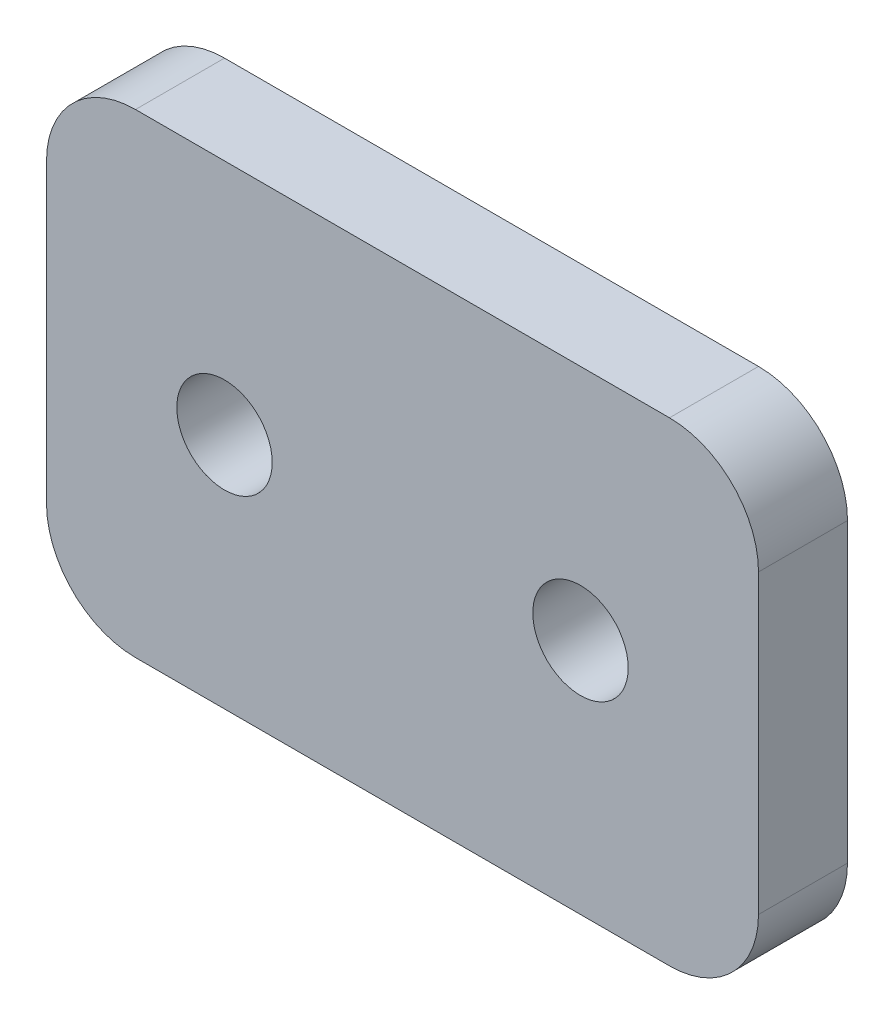
ISO-10303-21;
HEADER;
FILE_DESCRIPTION(('STEP AP214'),'2;1');
FILE_NAME('part.step','',(''),(''),'','','');
FILE_SCHEMA(('AUTOMOTIVE_DESIGN { 1 0 10303 214 1 1 1 1 }'));
ENDSEC;
DATA;
#1=APPLICATION_CONTEXT('core data for automotive mechanical design processes');
#2=APPLICATION_PROTOCOL_DEFINITION('international standard','automotive_design',2000,#1);
#3=PRODUCT_CONTEXT('',#1,'mechanical');
#4=PRODUCT('Part','Part','',(#3));
#5=PRODUCT_RELATED_PRODUCT_CATEGORY('part','',(#4));
#6=PRODUCT_DEFINITION_FORMATION('','',#4);
#7=PRODUCT_DEFINITION_CONTEXT('part definition',#1,'design');
#8=PRODUCT_DEFINITION('design','',#6,#7);
#9=PRODUCT_DEFINITION_SHAPE('','',#8);
#10=(LENGTH_UNIT() NAMED_UNIT(*) SI_UNIT(.MILLI.,.METRE.));
#11=(NAMED_UNIT(*) PLANE_ANGLE_UNIT() SI_UNIT($,.RADIAN.));
#12=(NAMED_UNIT(*) SI_UNIT($,.STERADIAN.) SOLID_ANGLE_UNIT());
#13=UNCERTAINTY_MEASURE_WITH_UNIT(LENGTH_MEASURE(1.E-05),#10,'distance_accuracy_value','');
#14=(GEOMETRIC_REPRESENTATION_CONTEXT(3) GLOBAL_UNCERTAINTY_ASSIGNED_CONTEXT((#13)) GLOBAL_UNIT_ASSIGNED_CONTEXT((#10,
#11,#12)) REPRESENTATION_CONTEXT('',''));
#15=CARTESIAN_POINT('',(0.,0.,0.));
#16=DIRECTION('',(0.,0.,1.));
#17=DIRECTION('',(1.,0.,0.));
#18=AXIS2_PLACEMENT_3D('',#15,#16,#17);
#19=CARTESIAN_POINT('',(0.,0.,4.7625));
#20=DIRECTION('',(0.,0.,-1.));
#21=DIRECTION('',(-1.,0.,0.));
#22=AXIS2_PLACEMENT_3D('',#19,#20,#21);
#23=PLANE('',#22);
#24=DIRECTION('',(-1.,0.,0.));
#25=VECTOR('',#24,1.);
#26=CARTESIAN_POINT('',(0.,25.4,4.7625));
#27=LINE('',#26,#25);
#28=CARTESIAN_POINT('',(33.3375,25.4,4.7625));
#29=VERTEX_POINT('',#28);
#30=CARTESIAN_POINT('',(4.7625,25.4,4.7625));
#31=VERTEX_POINT('',#30);
#32=EDGE_CURVE('E138',#29,#31,#27,.T.);
#33=ORIENTED_EDGE('',*,*,#32,.T.);
#34=CARTESIAN_POINT('',(4.7625,20.6375,4.7625));
#35=DIRECTION('',(0.,0.,-1.));
#36=DIRECTION('',(-1.,0.,0.));
#37=AXIS2_PLACEMENT_3D('',#34,#35,#36);
#38=CIRCLE('',#37,4.7625);
#39=CARTESIAN_POINT('',(0.,20.6375,4.7625));
#40=VERTEX_POINT('',#39);
#41=EDGE_CURVE('E157',#31,#40,#38,.F.);
#42=ORIENTED_EDGE('',*,*,#41,.T.);
#43=DIRECTION('',(0.,-1.,0.));
#44=VECTOR('',#43,1.);
#45=CARTESIAN_POINT('',(0.,0.,4.7625));
#46=LINE('',#45,#44);
#47=CARTESIAN_POINT('',(0.,4.7625,4.7625));
#48=VERTEX_POINT('',#47);
#49=EDGE_CURVE('E121',#40,#48,#46,.T.);
#50=ORIENTED_EDGE('',*,*,#49,.T.);
#51=CARTESIAN_POINT('',(4.7625,4.7625,4.7625));
#52=DIRECTION('',(0.,0.,-1.));
#53=DIRECTION('',(-1.,0.,0.));
#54=AXIS2_PLACEMENT_3D('',#51,#52,#53);
#55=CIRCLE('',#54,4.7625);
#56=CARTESIAN_POINT('',(4.7625,0.,4.7625));
#57=VERTEX_POINT('',#56);
#58=EDGE_CURVE('E155',#48,#57,#55,.F.);
#59=ORIENTED_EDGE('',*,*,#58,.T.);
#60=DIRECTION('',(1.,0.,0.));
#61=VECTOR('',#60,1.);
#62=CARTESIAN_POINT('',(0.,0.,4.7625));
#63=LINE('',#62,#61);
#64=CARTESIAN_POINT('',(33.3375,0.,4.7625));
#65=VERTEX_POINT('',#64);
#66=EDGE_CURVE('E168',#57,#65,#63,.T.);
#67=ORIENTED_EDGE('',*,*,#66,.T.);
#68=CARTESIAN_POINT('',(33.3375,4.7625,4.7625));
#69=DIRECTION('',(0.,0.,-1.));
#70=DIRECTION('',(-1.,0.,0.));
#71=AXIS2_PLACEMENT_3D('',#68,#69,#70);
#72=CIRCLE('',#71,4.7625);
#73=CARTESIAN_POINT('',(38.1,4.7625,4.7625));
#74=VERTEX_POINT('',#73);
#75=EDGE_CURVE('E56',#65,#74,#72,.F.);
#76=ORIENTED_EDGE('',*,*,#75,.T.);
#77=DIRECTION('',(0.,1.,0.));
#78=VECTOR('',#77,1.);
#79=CARTESIAN_POINT('',(38.1,0.,4.7625));
#80=LINE('',#79,#78);
#81=CARTESIAN_POINT('',(38.1,20.6375,4.7625));
#82=VERTEX_POINT('',#81);
#83=EDGE_CURVE('E176',#74,#82,#80,.T.);
#84=ORIENTED_EDGE('',*,*,#83,.T.);
#85=CARTESIAN_POINT('',(33.3375,20.6375,4.7625));
#86=DIRECTION('',(0.,0.,-1.));
#87=DIRECTION('',(-1.,0.,0.));
#88=AXIS2_PLACEMENT_3D('',#85,#86,#87);
#89=CIRCLE('',#88,4.7625);
#90=EDGE_CURVE('E152',#82,#29,#89,.F.);
#91=ORIENTED_EDGE('',*,*,#90,.T.);
#92=EDGE_LOOP('',(#33,#42,#50,#59,#67,#76,#84,#91));
#93=FACE_BOUND('',#92,.T.);
#94=CARTESIAN_POINT('',(9.525,12.7,4.7625));
#95=DIRECTION('',(0.,0.,1.));
#96=DIRECTION('',(1.,0.,0.));
#97=AXIS2_PLACEMENT_3D('',#94,#95,#96);
#98=CIRCLE('',#97,2.5527);
#99=CARTESIAN_POINT('',(12.0777,12.7,4.7625));
#100=VERTEX_POINT('',#99);
#101=EDGE_CURVE('E129',#100,#100,#98,.T.);
#102=ORIENTED_EDGE('',*,*,#101,.F.);
#103=EDGE_LOOP('',(#102));
#104=FACE_BOUND('',#103,.T.);
#105=CARTESIAN_POINT('',(28.575,12.7,4.7625));
#106=DIRECTION('',(0.,0.,1.));
#107=DIRECTION('',(1.,0.,0.));
#108=AXIS2_PLACEMENT_3D('',#105,#106,#107);
#109=CIRCLE('',#108,2.5527);
#110=CARTESIAN_POINT('',(31.1277,12.7,4.7625));
#111=VERTEX_POINT('',#110);
#112=EDGE_CURVE('E183',#111,#111,#109,.T.);
#113=ORIENTED_EDGE('',*,*,#112,.F.);
#114=EDGE_LOOP('',(#113));
#115=FACE_BOUND('',#114,.T.);
#116=ADVANCED_FACE('F35',(#93,#104,#115),#23,.F.);
#117=CARTESIAN_POINT('',(0.,0.,0.));
#118=DIRECTION('',(0.,0.,-1.));
#119=DIRECTION('',(-1.,0.,0.));
#120=AXIS2_PLACEMENT_3D('',#117,#118,#119);
#121=PLANE('',#120);
#122=CARTESIAN_POINT('',(9.525,12.7,0.));
#123=DIRECTION('',(0.,0.,1.));
#124=DIRECTION('',(1.,0.,0.));
#125=AXIS2_PLACEMENT_3D('',#122,#123,#124);
#126=CIRCLE('',#125,2.5527);
#127=CARTESIAN_POINT('',(12.0777,12.7,0.));
#128=VERTEX_POINT('',#127);
#129=EDGE_CURVE('E135',#128,#128,#126,.T.);
#130=ORIENTED_EDGE('',*,*,#129,.T.);
#131=EDGE_LOOP('',(#130));
#132=FACE_BOUND('',#131,.T.);
#133=DIRECTION('',(0.,-1.,0.));
#134=VECTOR('',#133,1.);
#135=CARTESIAN_POINT('',(0.,0.,0.));
#136=LINE('',#135,#134);
#137=CARTESIAN_POINT('',(0.,20.6375,0.));
#138=VERTEX_POINT('',#137);
#139=CARTESIAN_POINT('',(0.,4.7625,0.));
#140=VERTEX_POINT('',#139);
#141=EDGE_CURVE('E118',#138,#140,#136,.T.);
#142=ORIENTED_EDGE('',*,*,#141,.F.);
#143=CARTESIAN_POINT('',(4.7625,20.6375,0.));
#144=DIRECTION('',(0.,0.,-1.));
#145=DIRECTION('',(-1.,0.,0.));
#146=AXIS2_PLACEMENT_3D('',#143,#144,#145);
#147=CIRCLE('',#146,4.7625);
#148=CARTESIAN_POINT('',(4.7625,25.4,0.));
#149=VERTEX_POINT('',#148);
#150=EDGE_CURVE('E101',#138,#149,#147,.T.);
#151=ORIENTED_EDGE('',*,*,#150,.T.);
#152=DIRECTION('',(-1.,0.,0.));
#153=VECTOR('',#152,1.);
#154=CARTESIAN_POINT('',(0.,25.4,0.));
#155=LINE('',#154,#153);
#156=CARTESIAN_POINT('',(33.3375,25.4,0.));
#157=VERTEX_POINT('',#156);
#158=EDGE_CURVE('E142',#157,#149,#155,.T.);
#159=ORIENTED_EDGE('',*,*,#158,.F.);
#160=CARTESIAN_POINT('',(33.3375,20.6375,0.));
#161=DIRECTION('',(0.,0.,-1.));
#162=DIRECTION('',(-1.,0.,0.));
#163=AXIS2_PLACEMENT_3D('',#160,#161,#162);
#164=CIRCLE('',#163,4.7625);
#165=CARTESIAN_POINT('',(38.1,20.6375,0.));
#166=VERTEX_POINT('',#165);
#167=EDGE_CURVE('E122',#157,#166,#164,.T.);
#168=ORIENTED_EDGE('',*,*,#167,.T.);
#169=DIRECTION('',(0.,1.,0.));
#170=VECTOR('',#169,1.);
#171=CARTESIAN_POINT('',(38.1,0.,0.));
#172=LINE('',#171,#170);
#173=CARTESIAN_POINT('',(38.1,4.7625,0.));
#174=VERTEX_POINT('',#173);
#175=EDGE_CURVE('E132',#174,#166,#172,.T.);
#176=ORIENTED_EDGE('',*,*,#175,.F.);
#177=CARTESIAN_POINT('',(33.3375,4.7625,0.));
#178=DIRECTION('',(0.,0.,-1.));
#179=DIRECTION('',(-1.,0.,0.));
#180=AXIS2_PLACEMENT_3D('',#177,#178,#179);
#181=CIRCLE('',#180,4.7625);
#182=CARTESIAN_POINT('',(33.3375,0.,0.));
#183=VERTEX_POINT('',#182);
#184=EDGE_CURVE('E146',#174,#183,#181,.T.);
#185=ORIENTED_EDGE('',*,*,#184,.T.);
#186=DIRECTION('',(1.,0.,0.));
#187=VECTOR('',#186,1.);
#188=CARTESIAN_POINT('',(0.,0.,0.));
#189=LINE('',#188,#187);
#190=CARTESIAN_POINT('',(4.7625,0.,0.));
#191=VERTEX_POINT('',#190);
#192=EDGE_CURVE('E128',#191,#183,#189,.T.);
#193=ORIENTED_EDGE('',*,*,#192,.F.);
#194=CARTESIAN_POINT('',(4.7625,4.7625,0.));
#195=DIRECTION('',(0.,0.,-1.));
#196=DIRECTION('',(-1.,0.,0.));
#197=AXIS2_PLACEMENT_3D('',#194,#195,#196);
#198=CIRCLE('',#197,4.7625);
#199=EDGE_CURVE('E112',#191,#140,#198,.T.);
#200=ORIENTED_EDGE('',*,*,#199,.T.);
#201=EDGE_LOOP('',(#142,#151,#159,#168,#176,#185,#193,#200));
#202=FACE_BOUND('',#201,.T.);
#203=CARTESIAN_POINT('',(28.575,12.7,0.));
#204=DIRECTION('',(0.,0.,1.));
#205=DIRECTION('',(1.,0.,0.));
#206=AXIS2_PLACEMENT_3D('',#203,#204,#205);
#207=CIRCLE('',#206,2.5527);
#208=CARTESIAN_POINT('',(31.1277,12.7,0.));
#209=VERTEX_POINT('',#208);
#210=EDGE_CURVE('E185',#209,#209,#207,.T.);
#211=ORIENTED_EDGE('',*,*,#210,.T.);
#212=EDGE_LOOP('',(#211));
#213=FACE_BOUND('',#212,.T.);
#214=ADVANCED_FACE('F125',(#132,#202,#213),#121,.T.);
#215=CARTESIAN_POINT('',(0.,0.,4.7625));
#216=DIRECTION('',(1.,0.,0.));
#217=DIRECTION('',(0.,0.,-1.));
#218=AXIS2_PLACEMENT_3D('',#215,#216,#217);
#219=PLANE('',#218);
#220=ORIENTED_EDGE('',*,*,#49,.F.);
#221=DIRECTION('',(0.,0.,-1.));
#222=VECTOR('',#221,1.);
#223=CARTESIAN_POINT('',(0.,20.6375,4.7625));
#224=LINE('',#223,#222);
#225=EDGE_CURVE('E105',#40,#138,#224,.T.);
#226=ORIENTED_EDGE('',*,*,#225,.T.);
#227=ORIENTED_EDGE('',*,*,#141,.T.);
#228=DIRECTION('',(0.,0.,-1.));
#229=VECTOR('',#228,1.);
#230=CARTESIAN_POINT('',(0.,4.7625,4.7625));
#231=LINE('',#230,#229);
#232=EDGE_CURVE('E123',#140,#48,#231,.F.);
#233=ORIENTED_EDGE('',*,*,#232,.T.);
#234=EDGE_LOOP('',(#220,#226,#227,#233));
#235=FACE_BOUND('',#234,.T.);
#236=ADVANCED_FACE('F117',(#235),#219,.F.);
#237=CARTESIAN_POINT('',(0.,0.,4.7625));
#238=DIRECTION('',(0.,1.,0.));
#239=DIRECTION('',(0.,0.,1.));
#240=AXIS2_PLACEMENT_3D('',#237,#238,#239);
#241=PLANE('',#240);
#242=ORIENTED_EDGE('',*,*,#66,.F.);
#243=DIRECTION('',(0.,0.,-1.));
#244=VECTOR('',#243,1.);
#245=CARTESIAN_POINT('',(4.7625,0.,4.7625));
#246=LINE('',#245,#244);
#247=EDGE_CURVE('E161',#57,#191,#246,.T.);
#248=ORIENTED_EDGE('',*,*,#247,.T.);
#249=ORIENTED_EDGE('',*,*,#192,.T.);
#250=DIRECTION('',(0.,0.,-1.));
#251=VECTOR('',#250,1.);
#252=CARTESIAN_POINT('',(33.3375,0.,4.7625));
#253=LINE('',#252,#251);
#254=EDGE_CURVE('E159',#183,#65,#253,.F.);
#255=ORIENTED_EDGE('',*,*,#254,.T.);
#256=EDGE_LOOP('',(#242,#248,#249,#255));
#257=FACE_BOUND('',#256,.T.);
#258=ADVANCED_FACE('F166',(#257),#241,.F.);
#259=CARTESIAN_POINT('',(38.1,0.,4.7625));
#260=DIRECTION('',(-1.,0.,0.));
#261=DIRECTION('',(0.,0.,1.));
#262=AXIS2_PLACEMENT_3D('',#259,#260,#261);
#263=PLANE('',#262);
#264=ORIENTED_EDGE('',*,*,#83,.F.);
#265=DIRECTION('',(0.,0.,-1.));
#266=VECTOR('',#265,1.);
#267=CARTESIAN_POINT('',(38.1,4.7625,4.7625));
#268=LINE('',#267,#266);
#269=EDGE_CURVE('E11',#74,#174,#268,.T.);
#270=ORIENTED_EDGE('',*,*,#269,.T.);
#271=ORIENTED_EDGE('',*,*,#175,.T.);
#272=DIRECTION('',(0.,0.,-1.));
#273=VECTOR('',#272,1.);
#274=CARTESIAN_POINT('',(38.1,20.6375,4.7625));
#275=LINE('',#274,#273);
#276=EDGE_CURVE('E43',#166,#82,#275,.F.);
#277=ORIENTED_EDGE('',*,*,#276,.T.);
#278=EDGE_LOOP('',(#264,#270,#271,#277));
#279=FACE_BOUND('',#278,.T.);
#280=ADVANCED_FACE('F175',(#279),#263,.F.);
#281=CARTESIAN_POINT('',(0.,25.4,4.7625));
#282=DIRECTION('',(0.,-1.,0.));
#283=DIRECTION('',(0.,0.,-1.));
#284=AXIS2_PLACEMENT_3D('',#281,#282,#283);
#285=PLANE('',#284);
#286=ORIENTED_EDGE('',*,*,#158,.T.);
#287=DIRECTION('',(0.,0.,-1.));
#288=VECTOR('',#287,1.);
#289=CARTESIAN_POINT('',(4.7625,25.4,4.7625));
#290=LINE('',#289,#288);
#291=EDGE_CURVE('E106',#149,#31,#290,.F.);
#292=ORIENTED_EDGE('',*,*,#291,.T.);
#293=ORIENTED_EDGE('',*,*,#32,.F.);
#294=DIRECTION('',(0.,0.,-1.));
#295=VECTOR('',#294,1.);
#296=CARTESIAN_POINT('',(33.3375,25.4,4.7625));
#297=LINE('',#296,#295);
#298=EDGE_CURVE('E111',#29,#157,#297,.T.);
#299=ORIENTED_EDGE('',*,*,#298,.T.);
#300=EDGE_LOOP('',(#286,#292,#293,#299));
#301=FACE_BOUND('',#300,.T.);
#302=ADVANCED_FACE('F206',(#301),#285,.F.);
#303=CARTESIAN_POINT('',(9.525,12.7,4.7625));
#304=DIRECTION('',(0.,0.,-1.));
#305=DIRECTION('',(-1.,0.,0.));
#306=AXIS2_PLACEMENT_3D('',#303,#304,#305);
#307=CYLINDRICAL_SURFACE('',#306,2.5527);
#308=ORIENTED_EDGE('',*,*,#101,.T.);
#309=EDGE_LOOP('',(#308));
#310=FACE_BOUND('',#309,.T.);
#311=ORIENTED_EDGE('',*,*,#129,.F.);
#312=EDGE_LOOP('',(#311));
#313=FACE_BOUND('',#312,.T.);
#314=ADVANCED_FACE('F203',(#310,#313),#307,.F.);
#315=CARTESIAN_POINT('',(28.575,12.7,4.7625));
#316=DIRECTION('',(0.,0.,-1.));
#317=DIRECTION('',(-1.,0.,0.));
#318=AXIS2_PLACEMENT_3D('',#315,#316,#317);
#319=CYLINDRICAL_SURFACE('',#318,2.5527);
#320=ORIENTED_EDGE('',*,*,#112,.T.);
#321=EDGE_LOOP('',(#320));
#322=FACE_BOUND('',#321,.T.);
#323=ORIENTED_EDGE('',*,*,#210,.F.);
#324=EDGE_LOOP('',(#323));
#325=FACE_BOUND('',#324,.T.);
#326=ADVANCED_FACE('F191',(#322,#325),#319,.F.);
#327=CARTESIAN_POINT('',(4.7625,20.6375,4.7625));
#328=DIRECTION('',(0.,0.,-1.));
#329=DIRECTION('',(-1.,0.,0.));
#330=AXIS2_PLACEMENT_3D('',#327,#328,#329);
#331=CYLINDRICAL_SURFACE('',#330,4.7625);
#332=ORIENTED_EDGE('',*,*,#41,.F.);
#333=ORIENTED_EDGE('',*,*,#291,.F.);
#334=ORIENTED_EDGE('',*,*,#150,.F.);
#335=ORIENTED_EDGE('',*,*,#225,.F.);
#336=EDGE_LOOP('',(#332,#333,#334,#335));
#337=FACE_BOUND('',#336,.T.);
#338=ADVANCED_FACE('F104',(#337),#331,.T.);
#339=CARTESIAN_POINT('',(4.7625,4.7625,4.7625));
#340=DIRECTION('',(0.,0.,-1.));
#341=DIRECTION('',(-1.,0.,0.));
#342=AXIS2_PLACEMENT_3D('',#339,#340,#341);
#343=CYLINDRICAL_SURFACE('',#342,4.7625);
#344=ORIENTED_EDGE('',*,*,#58,.F.);
#345=ORIENTED_EDGE('',*,*,#232,.F.);
#346=ORIENTED_EDGE('',*,*,#199,.F.);
#347=ORIENTED_EDGE('',*,*,#247,.F.);
#348=EDGE_LOOP('',(#344,#345,#346,#347));
#349=FACE_BOUND('',#348,.T.);
#350=ADVANCED_FACE('F218',(#349),#343,.T.);
#351=CARTESIAN_POINT('',(33.3375,4.7625,4.7625));
#352=DIRECTION('',(0.,0.,-1.));
#353=DIRECTION('',(-1.,0.,0.));
#354=AXIS2_PLACEMENT_3D('',#351,#352,#353);
#355=CYLINDRICAL_SURFACE('',#354,4.7625);
#356=ORIENTED_EDGE('',*,*,#75,.F.);
#357=ORIENTED_EDGE('',*,*,#254,.F.);
#358=ORIENTED_EDGE('',*,*,#184,.F.);
#359=ORIENTED_EDGE('',*,*,#269,.F.);
#360=EDGE_LOOP('',(#356,#357,#358,#359));
#361=FACE_BOUND('',#360,.T.);
#362=ADVANCED_FACE('F174',(#361),#355,.T.);
#363=CARTESIAN_POINT('',(33.3375,20.6375,4.7625));
#364=DIRECTION('',(0.,0.,-1.));
#365=DIRECTION('',(-1.,0.,0.));
#366=AXIS2_PLACEMENT_3D('',#363,#364,#365);
#367=CYLINDRICAL_SURFACE('',#366,4.7625);
#368=ORIENTED_EDGE('',*,*,#90,.F.);
#369=ORIENTED_EDGE('',*,*,#276,.F.);
#370=ORIENTED_EDGE('',*,*,#167,.F.);
#371=ORIENTED_EDGE('',*,*,#298,.F.);
#372=EDGE_LOOP('',(#368,#369,#370,#371));
#373=FACE_BOUND('',#372,.T.);
#374=ADVANCED_FACE('F37',(#373),#367,.T.);
#375=CLOSED_SHELL('',(#116,#214,#236,#258,#280,#302,#314,#326,#338,#350,#362,#374));
#376=MANIFOLD_SOLID_BREP('B2',#375);
#377=ADVANCED_BREP_SHAPE_REPRESENTATION('',(#18,#376),#14);
#378=SHAPE_DEFINITION_REPRESENTATION(#9,#377);
ENDSEC;
END-ISO-10303-21;
